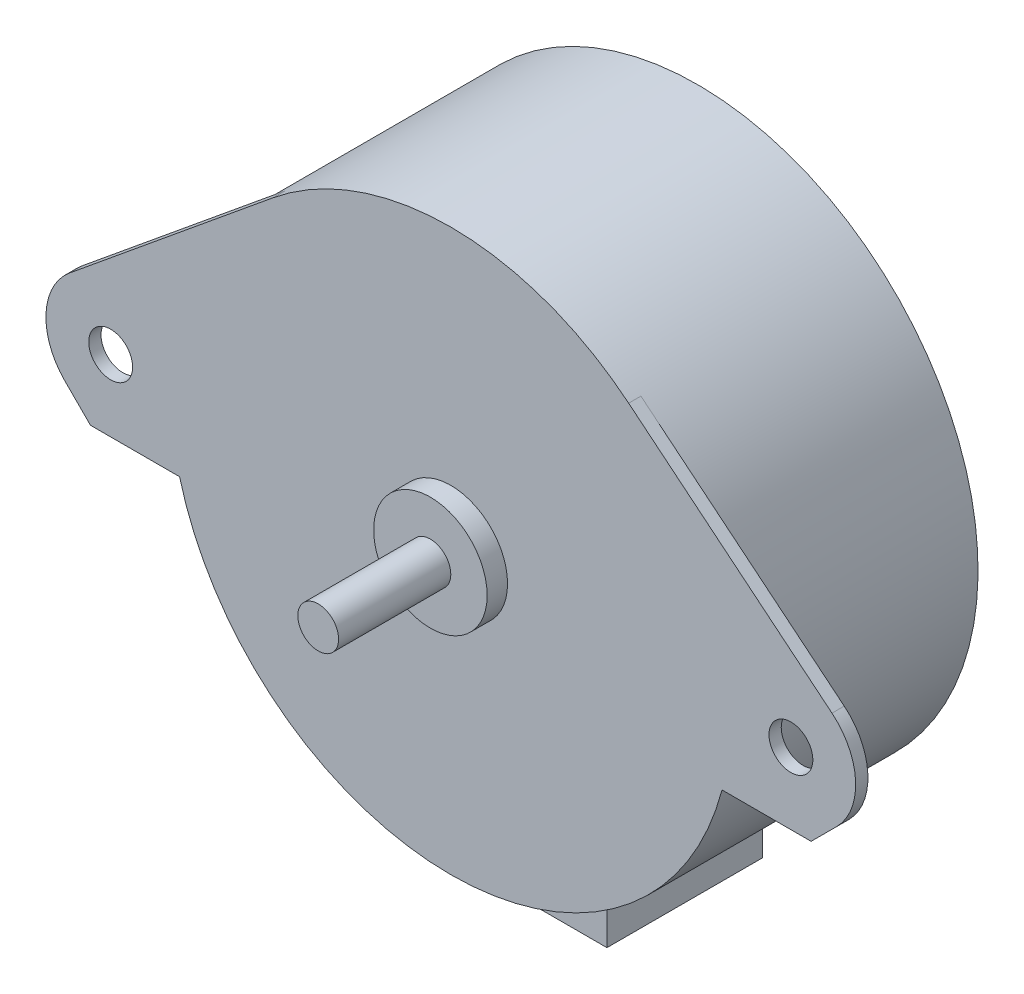
ISO-10303-21;
HEADER;
FILE_DESCRIPTION(('STEP AP214'),'2;1');
FILE_NAME('part.step','',(''),(''),'','','');
FILE_SCHEMA(('AUTOMOTIVE_DESIGN { 1 0 10303 214 1 1 1 1 }'));
ENDSEC;
DATA;
#1=APPLICATION_CONTEXT('core data for automotive mechanical design processes');
#2=APPLICATION_PROTOCOL_DEFINITION('international standard','automotive_design',2000,#1);
#3=PRODUCT_CONTEXT('',#1,'mechanical');
#4=PRODUCT('Part','Part','',(#3));
#5=PRODUCT_RELATED_PRODUCT_CATEGORY('part','',(#4));
#6=PRODUCT_DEFINITION_FORMATION('','',#4);
#7=PRODUCT_DEFINITION_CONTEXT('part definition',#1,'design');
#8=PRODUCT_DEFINITION('design','',#6,#7);
#9=PRODUCT_DEFINITION_SHAPE('','',#8);
#10=(LENGTH_UNIT() NAMED_UNIT(*) SI_UNIT(.MILLI.,.METRE.));
#11=(NAMED_UNIT(*) PLANE_ANGLE_UNIT() SI_UNIT($,.RADIAN.));
#12=(NAMED_UNIT(*) SI_UNIT($,.STERADIAN.) SOLID_ANGLE_UNIT());
#13=UNCERTAINTY_MEASURE_WITH_UNIT(LENGTH_MEASURE(1.E-05),#10,'distance_accuracy_value','');
#14=(GEOMETRIC_REPRESENTATION_CONTEXT(3) GLOBAL_UNCERTAINTY_ASSIGNED_CONTEXT((#13)) GLOBAL_UNIT_ASSIGNED_CONTEXT((#10,
#11,#12)) REPRESENTATION_CONTEXT('',''));
#15=CARTESIAN_POINT('',(0.,0.,0.));
#16=DIRECTION('',(0.,0.,1.));
#17=DIRECTION('',(1.,0.,0.));
#18=AXIS2_PLACEMENT_3D('',#15,#16,#17);
#19=CARTESIAN_POINT('',(0.,0.,0.));
#20=DIRECTION('',(0.,0.,1.));
#21=DIRECTION('',(1.,0.,0.));
#22=AXIS2_PLACEMENT_3D('',#19,#20,#21);
#23=PLANE('',#22);
#24=CARTESIAN_POINT('',(0.,0.,0.));
#25=DIRECTION('',(0.,0.,1.));
#26=DIRECTION('',(1.,0.,0.));
#27=AXIS2_PLACEMENT_3D('',#24,#25,#26);
#28=CIRCLE('',#27,2.);
#29=CARTESIAN_POINT('',(2.,0.,0.));
#30=VERTEX_POINT('',#29);
#31=EDGE_CURVE('E263',#30,#30,#28,.T.);
#32=ORIENTED_EDGE('',*,*,#31,.F.);
#33=EDGE_LOOP('',(#32));
#34=FACE_BOUND('',#33,.T.);
#35=ADVANCED_FACE('F33',(#34),#23,.F.);
#36=CARTESIAN_POINT('',(0.,0.,38.2));
#37=DIRECTION('',(0.,0.,1.));
#38=DIRECTION('',(1.,0.,0.));
#39=AXIS2_PLACEMENT_3D('',#36,#37,#38);
#40=CYLINDRICAL_SURFACE('',#39,2.);
#41=CARTESIAN_POINT('',(0.,0.,1.));
#42=DIRECTION('',(0.,0.,1.));
#43=DIRECTION('',(1.,0.,0.));
#44=AXIS2_PLACEMENT_3D('',#41,#42,#43);
#45=CIRCLE('',#44,2.);
#46=CARTESIAN_POINT('',(2.,0.,1.));
#47=VERTEX_POINT('',#46);
#48=EDGE_CURVE('E260',#47,#47,#45,.T.);
#49=ORIENTED_EDGE('',*,*,#48,.F.);
#50=EDGE_LOOP('',(#49));
#51=FACE_BOUND('',#50,.T.);
#52=ORIENTED_EDGE('',*,*,#31,.T.);
#53=EDGE_LOOP('',(#52));
#54=FACE_BOUND('',#53,.T.);
#55=ADVANCED_FACE('F287',(#51,#54),#40,.T.);
#56=CARTESIAN_POINT('',(0.,2.,1.));
#57=DIRECTION('',(0.,0.,1.));
#58=DIRECTION('',(1.,0.,0.));
#59=AXIS2_PLACEMENT_3D('',#56,#57,#58);
#60=PLANE('',#59);
#61=DIRECTION('',(0.,1.,0.));
#62=VECTOR('',#61,1.);
#63=CARTESIAN_POINT('',(-6.35,-35.,1.));
#64=LINE('',#63,#62);
#65=CARTESIAN_POINT('',(-6.35,-35.,1.));
#66=VERTEX_POINT('',#65);
#67=CARTESIAN_POINT('',(-6.35,-26.7568215601181,1.));
#68=VERTEX_POINT('',#67);
#69=EDGE_CURVE('E154',#66,#68,#64,.T.);
#70=ORIENTED_EDGE('',*,*,#69,.T.);
#71=CARTESIAN_POINT('',(0.,0.,1.));
#72=DIRECTION('',(0.,0.,1.));
#73=DIRECTION('',(1.,0.,0.));
#74=AXIS2_PLACEMENT_3D('',#71,#72,#73);
#75=CIRCLE('',#74,27.5);
#76=CARTESIAN_POINT('',(6.35,-26.7568215601181,1.));
#77=VERTEX_POINT('',#76);
#78=EDGE_CURVE('E257',#77,#68,#75,.T.);
#79=ORIENTED_EDGE('',*,*,#78,.F.);
#80=DIRECTION('',(0.,1.,0.));
#81=VECTOR('',#80,1.);
#82=CARTESIAN_POINT('',(6.35,-35.,1.));
#83=LINE('',#82,#81);
#84=CARTESIAN_POINT('',(6.35,-35.,1.));
#85=VERTEX_POINT('',#84);
#86=EDGE_CURVE('E161',#85,#77,#83,.T.);
#87=ORIENTED_EDGE('',*,*,#86,.F.);
#88=DIRECTION('',(-1.,0.,0.));
#89=VECTOR('',#88,1.);
#90=CARTESIAN_POINT('',(-6.35,-35.,1.));
#91=LINE('',#90,#89);
#92=EDGE_CURVE('E140',#85,#66,#91,.T.);
#93=ORIENTED_EDGE('',*,*,#92,.T.);
#94=EDGE_LOOP('',(#70,#79,#87,#93));
#95=FACE_BOUND('',#94,.T.);
#96=ORIENTED_EDGE('',*,*,#48,.T.);
#97=EDGE_LOOP('',(#96));
#98=FACE_BOUND('',#97,.T.);
#99=ADVANCED_FACE('F273',(#95,#98),#60,.F.);
#100=CARTESIAN_POINT('',(0.,0.,38.2));
#101=DIRECTION('',(0.,0.,1.));
#102=DIRECTION('',(1.,0.,0.));
#103=AXIS2_PLACEMENT_3D('',#100,#101,#102);
#104=CYLINDRICAL_SURFACE('',#103,27.5);
#105=ORIENTED_EDGE('',*,*,#78,.T.);
#106=DIRECTION('',(0.,0.,1.));
#107=VECTOR('',#106,1.);
#108=CARTESIAN_POINT('',(-6.35000000000001,-26.7568215601181,38.2));
#109=LINE('',#108,#107);
#110=CARTESIAN_POINT('',(-6.35,-26.7568215601181,16.24));
#111=VERTEX_POINT('',#110);
#112=EDGE_CURVE('E11',#68,#111,#109,.T.);
#113=ORIENTED_EDGE('',*,*,#112,.T.);
#114=CARTESIAN_POINT('',(0.,0.,16.24));
#115=DIRECTION('',(0.,0.,1.));
#116=DIRECTION('',(1.,0.,0.));
#117=AXIS2_PLACEMENT_3D('',#114,#115,#116);
#118=CIRCLE('',#117,27.5);
#119=CARTESIAN_POINT('',(6.35,-26.7568215601181,16.24));
#120=VERTEX_POINT('',#119);
#121=EDGE_CURVE('E137',#111,#120,#118,.T.);
#122=ORIENTED_EDGE('',*,*,#121,.T.);
#123=DIRECTION('',(0.,0.,1.));
#124=VECTOR('',#123,1.);
#125=CARTESIAN_POINT('',(6.35000000000001,-26.7568215601181,38.2));
#126=LINE('',#125,#124);
#127=EDGE_CURVE('E40',#120,#77,#126,.F.);
#128=ORIENTED_EDGE('',*,*,#127,.T.);
#129=EDGE_LOOP('',(#105,#113,#122,#128));
#130=FACE_BOUND('',#129,.T.);
#131=CARTESIAN_POINT('',(0.,0.,24.));
#132=DIRECTION('',(0.,0.,1.));
#133=DIRECTION('',(1.,0.,0.));
#134=AXIS2_PLACEMENT_3D('',#131,#132,#133);
#135=CIRCLE('',#134,27.5);
#136=CARTESIAN_POINT('',(-17.4400299850075,21.2625340475222,24.));
#137=VERTEX_POINT('',#136);
#138=CARTESIAN_POINT('',(-26.5941722939444,-7.,24.));
#139=VERTEX_POINT('',#138);
#140=EDGE_CURVE('E55',#137,#139,#135,.T.);
#141=ORIENTED_EDGE('',*,*,#140,.F.);
#142=DIRECTION('',(0.,0.,-1.));
#143=VECTOR('',#142,1.);
#144=CARTESIAN_POINT('',(-17.4400299850075,21.2625340475222,25.2));
#145=LINE('',#144,#143);
#146=CARTESIAN_POINT('',(-17.4400299850075,21.2625340475222,25.2));
#147=VERTEX_POINT('',#146);
#148=EDGE_CURVE('E243',#147,#137,#145,.T.);
#149=ORIENTED_EDGE('',*,*,#148,.F.);
#150=CARTESIAN_POINT('',(0.,0.,25.2));
#151=DIRECTION('',(0.,0.,1.));
#152=DIRECTION('',(1.,0.,0.));
#153=AXIS2_PLACEMENT_3D('',#150,#151,#152);
#154=CIRCLE('',#153,27.5);
#155=CARTESIAN_POINT('',(17.4400299850075,21.2625340475222,25.2));
#156=VERTEX_POINT('',#155);
#157=EDGE_CURVE('E179',#156,#147,#154,.T.);
#158=ORIENTED_EDGE('',*,*,#157,.F.);
#159=DIRECTION('',(0.,0.,-1.));
#160=VECTOR('',#159,1.);
#161=CARTESIAN_POINT('',(17.4400299850075,21.2625340475222,25.2));
#162=LINE('',#161,#160);
#163=CARTESIAN_POINT('',(17.4400299850075,21.2625340475222,24.));
#164=VERTEX_POINT('',#163);
#165=EDGE_CURVE('E201',#156,#164,#162,.T.);
#166=ORIENTED_EDGE('',*,*,#165,.T.);
#167=CARTESIAN_POINT('',(26.5941722939444,-7.,24.));
#168=VERTEX_POINT('',#167);
#169=EDGE_CURVE('E246',#168,#164,#135,.T.);
#170=ORIENTED_EDGE('',*,*,#169,.F.);
#171=DIRECTION('',(0.,0.,-1.));
#172=VECTOR('',#171,1.);
#173=CARTESIAN_POINT('',(26.5941722939444,-7.,25.2));
#174=LINE('',#173,#172);
#175=CARTESIAN_POINT('',(26.5941722939444,-7.,25.2));
#176=VERTEX_POINT('',#175);
#177=EDGE_CURVE('E228',#176,#168,#174,.T.);
#178=ORIENTED_EDGE('',*,*,#177,.F.);
#179=CARTESIAN_POINT('',(0.,0.,25.2));
#180=DIRECTION('',(0.,0.,1.));
#181=DIRECTION('',(1.,0.,0.));
#182=AXIS2_PLACEMENT_3D('',#179,#180,#181);
#183=CIRCLE('',#182,27.5);
#184=CARTESIAN_POINT('',(-26.5941722939444,-7.,25.2));
#185=VERTEX_POINT('',#184);
#186=EDGE_CURVE('E191',#185,#176,#183,.T.);
#187=ORIENTED_EDGE('',*,*,#186,.F.);
#188=DIRECTION('',(0.,0.,-1.));
#189=VECTOR('',#188,1.);
#190=CARTESIAN_POINT('',(-26.5941722939444,-7.,25.2));
#191=LINE('',#190,#189);
#192=EDGE_CURVE('E231',#185,#139,#191,.T.);
#193=ORIENTED_EDGE('',*,*,#192,.T.);
#194=EDGE_LOOP('',(#141,#149,#158,#166,#170,#178,#187,#193));
#195=FACE_BOUND('',#194,.T.);
#196=ADVANCED_FACE('F269',(#130,#195),#104,.T.);
#197=CARTESIAN_POINT('',(0.,0.,24.));
#198=DIRECTION('',(0.,0.,1.));
#199=DIRECTION('',(1.,0.,0.));
#200=AXIS2_PLACEMENT_3D('',#197,#198,#199);
#201=PLANE('',#200);
#202=CARTESIAN_POINT('',(-33.35,0.,24.));
#203=DIRECTION('',(0.,0.,1.));
#204=DIRECTION('',(1.,0.,0.));
#205=AXIS2_PLACEMENT_3D('',#202,#203,#204);
#206=CIRCLE('',#205,2.15);
#207=CARTESIAN_POINT('',(-31.2,0.,24.));
#208=VERTEX_POINT('',#207);
#209=EDGE_CURVE('E167',#208,#208,#206,.T.);
#210=ORIENTED_EDGE('',*,*,#209,.T.);
#211=EDGE_LOOP('',(#210));
#212=FACE_BOUND('',#211,.T.);
#213=DIRECTION('',(-0.773183056273534,-0.634182908545727,0.));
#214=VECTOR('',#213,1.);
#215=CARTESIAN_POINT('',(-17.4400299850075,21.2625340475222,24.));
#216=LINE('',#215,#214);
#217=CARTESIAN_POINT('',(-37.3770614692654,4.90971240733694,24.));
#218=VERTEX_POINT('',#217);
#219=EDGE_CURVE('E178',#137,#218,#216,.T.);
#220=ORIENTED_EDGE('',*,*,#219,.F.);
#221=ORIENTED_EDGE('',*,*,#140,.T.);
#222=DIRECTION('',(1.,0.,0.));
#223=VECTOR('',#222,1.);
#224=CARTESIAN_POINT('',(-35.3302561210692,-7.,24.));
#225=LINE('',#224,#223);
#226=CARTESIAN_POINT('',(-35.3302561210692,-7.,24.));
#227=VERTEX_POINT('',#226);
#228=EDGE_CURVE('E207',#227,#139,#225,.T.);
#229=ORIENTED_EDGE('',*,*,#228,.F.);
#230=DIRECTION('',(0.707106781186547,-0.707106781186548,0.));
#231=VECTOR('',#230,1.);
#232=CARTESIAN_POINT('',(-37.8401280605346,-4.49012806053457,24.));
#233=LINE('',#232,#231);
#234=CARTESIAN_POINT('',(-37.8401280605346,-4.49012806053457,24.));
#235=VERTEX_POINT('',#234);
#236=EDGE_CURVE('E205',#235,#227,#233,.T.);
#237=ORIENTED_EDGE('',*,*,#236,.F.);
#238=CARTESIAN_POINT('',(-33.35,0.,24.));
#239=DIRECTION('',(0.,0.,1.));
#240=DIRECTION('',(1.,0.,0.));
#241=AXIS2_PLACEMENT_3D('',#238,#239,#240);
#242=CIRCLE('',#241,6.35);
#243=EDGE_CURVE('E203',#218,#235,#242,.T.);
#244=ORIENTED_EDGE('',*,*,#243,.F.);
#245=EDGE_LOOP('',(#220,#221,#229,#237,#244));
#246=FACE_BOUND('',#245,.T.);
#247=ADVANCED_FACE('F303',(#212,#246),#201,.F.);
#248=CARTESIAN_POINT('',(33.35,0.,24.));
#249=DIRECTION('',(0.,0.,1.));
#250=DIRECTION('',(-1.,0.,0.));
#251=AXIS2_PLACEMENT_3D('',#248,#249,#250);
#252=CIRCLE('',#251,2.15);
#253=CARTESIAN_POINT('',(31.2,0.,24.));
#254=VERTEX_POINT('',#253);
#255=EDGE_CURVE('E160',#254,#254,#252,.T.);
#256=ORIENTED_EDGE('',*,*,#255,.T.);
#257=EDGE_LOOP('',(#256));
#258=FACE_BOUND('',#257,.T.);
#259=DIRECTION('',(1.,0.,0.));
#260=VECTOR('',#259,1.);
#261=CARTESIAN_POINT('',(35.3302561210692,-7.,24.));
#262=LINE('',#261,#260);
#263=CARTESIAN_POINT('',(35.3302561210692,-7.,24.));
#264=VERTEX_POINT('',#263);
#265=EDGE_CURVE('E209',#168,#264,#262,.T.);
#266=ORIENTED_EDGE('',*,*,#265,.F.);
#267=ORIENTED_EDGE('',*,*,#169,.T.);
#268=DIRECTION('',(-0.773183056273534,0.634182908545727,0.));
#269=VECTOR('',#268,1.);
#270=CARTESIAN_POINT('',(17.4400299850075,21.2625340475222,24.));
#271=LINE('',#270,#269);
#272=CARTESIAN_POINT('',(37.3770614692654,4.90971240733695,24.));
#273=VERTEX_POINT('',#272);
#274=EDGE_CURVE('E183',#273,#164,#271,.T.);
#275=ORIENTED_EDGE('',*,*,#274,.F.);
#276=CARTESIAN_POINT('',(33.35,0.,24.));
#277=DIRECTION('',(0.,0.,1.));
#278=DIRECTION('',(-1.,0.,0.));
#279=AXIS2_PLACEMENT_3D('',#276,#277,#278);
#280=CIRCLE('',#279,6.35);
#281=CARTESIAN_POINT('',(37.8401280605346,-4.49012806053457,24.));
#282=VERTEX_POINT('',#281);
#283=EDGE_CURVE('E213',#282,#273,#280,.T.);
#284=ORIENTED_EDGE('',*,*,#283,.F.);
#285=DIRECTION('',(0.707106781186547,0.707106781186548,0.));
#286=VECTOR('',#285,1.);
#287=CARTESIAN_POINT('',(37.8401280605346,-4.49012806053457,24.));
#288=LINE('',#287,#286);
#289=EDGE_CURVE('E211',#264,#282,#288,.T.);
#290=ORIENTED_EDGE('',*,*,#289,.F.);
#291=EDGE_LOOP('',(#266,#267,#275,#284,#290));
#292=FACE_BOUND('',#291,.T.);
#293=ADVANCED_FACE('F356',(#258,#292),#201,.F.);
#294=CARTESIAN_POINT('',(0.,0.,25.2));
#295=DIRECTION('',(0.,0.,1.));
#296=DIRECTION('',(1.,0.,0.));
#297=AXIS2_PLACEMENT_3D('',#294,#295,#296);
#298=PLANE('',#297);
#299=CARTESIAN_POINT('',(-33.35,0.,25.2));
#300=DIRECTION('',(0.,0.,1.));
#301=DIRECTION('',(1.,0.,0.));
#302=AXIS2_PLACEMENT_3D('',#299,#300,#301);
#303=CIRCLE('',#302,2.15);
#304=CARTESIAN_POINT('',(-31.2,0.,25.2));
#305=VERTEX_POINT('',#304);
#306=EDGE_CURVE('E170',#305,#305,#303,.T.);
#307=ORIENTED_EDGE('',*,*,#306,.F.);
#308=EDGE_LOOP('',(#307));
#309=FACE_BOUND('',#308,.T.);
#310=ORIENTED_EDGE('',*,*,#157,.T.);
#311=DIRECTION('',(-0.773183056273534,-0.634182908545727,0.));
#312=VECTOR('',#311,1.);
#313=CARTESIAN_POINT('',(-17.4400299850075,21.2625340475222,25.2));
#314=LINE('',#313,#312);
#315=CARTESIAN_POINT('',(-37.3770614692654,4.90971240733694,25.2));
#316=VERTEX_POINT('',#315);
#317=EDGE_CURVE('E182',#147,#316,#314,.T.);
#318=ORIENTED_EDGE('',*,*,#317,.T.);
#319=CARTESIAN_POINT('',(-33.35,0.,25.2));
#320=DIRECTION('',(0.,0.,1.));
#321=DIRECTION('',(1.,0.,0.));
#322=AXIS2_PLACEMENT_3D('',#319,#320,#321);
#323=CIRCLE('',#322,6.35);
#324=CARTESIAN_POINT('',(-37.8401280605346,-4.49012806053457,25.2));
#325=VERTEX_POINT('',#324);
#326=EDGE_CURVE('E185',#316,#325,#323,.T.);
#327=ORIENTED_EDGE('',*,*,#326,.T.);
#328=DIRECTION('',(0.707106781186547,-0.707106781186548,0.));
#329=VECTOR('',#328,1.);
#330=CARTESIAN_POINT('',(-37.8401280605346,-4.49012806053457,25.2));
#331=LINE('',#330,#329);
#332=CARTESIAN_POINT('',(-35.3302561210692,-7.,25.2));
#333=VERTEX_POINT('',#332);
#334=EDGE_CURVE('E187',#325,#333,#331,.T.);
#335=ORIENTED_EDGE('',*,*,#334,.T.);
#336=DIRECTION('',(1.,0.,0.));
#337=VECTOR('',#336,1.);
#338=CARTESIAN_POINT('',(-35.3302561210692,-7.,25.2));
#339=LINE('',#338,#337);
#340=EDGE_CURVE('E189',#333,#185,#339,.T.);
#341=ORIENTED_EDGE('',*,*,#340,.T.);
#342=ORIENTED_EDGE('',*,*,#186,.T.);
#343=DIRECTION('',(1.,0.,0.));
#344=VECTOR('',#343,1.);
#345=CARTESIAN_POINT('',(35.3302561210692,-7.,25.2));
#346=LINE('',#345,#344);
#347=CARTESIAN_POINT('',(35.3302561210692,-7.,25.2));
#348=VERTEX_POINT('',#347);
#349=EDGE_CURVE('E193',#176,#348,#346,.T.);
#350=ORIENTED_EDGE('',*,*,#349,.T.);
#351=DIRECTION('',(0.707106781186547,0.707106781186548,0.));
#352=VECTOR('',#351,1.);
#353=CARTESIAN_POINT('',(37.8401280605346,-4.49012806053457,25.2));
#354=LINE('',#353,#352);
#355=CARTESIAN_POINT('',(37.8401280605346,-4.49012806053457,25.2));
#356=VERTEX_POINT('',#355);
#357=EDGE_CURVE('E195',#348,#356,#354,.T.);
#358=ORIENTED_EDGE('',*,*,#357,.T.);
#359=CARTESIAN_POINT('',(33.35,0.,25.2));
#360=DIRECTION('',(0.,0.,1.));
#361=DIRECTION('',(-1.,0.,0.));
#362=AXIS2_PLACEMENT_3D('',#359,#360,#361);
#363=CIRCLE('',#362,6.35);
#364=CARTESIAN_POINT('',(37.3770614692654,4.90971240733695,25.2));
#365=VERTEX_POINT('',#364);
#366=EDGE_CURVE('E197',#356,#365,#363,.T.);
#367=ORIENTED_EDGE('',*,*,#366,.T.);
#368=DIRECTION('',(-0.773183056273534,0.634182908545727,0.));
#369=VECTOR('',#368,1.);
#370=CARTESIAN_POINT('',(17.4400299850075,21.2625340475222,25.2));
#371=LINE('',#370,#369);
#372=EDGE_CURVE('E199',#365,#156,#371,.T.);
#373=ORIENTED_EDGE('',*,*,#372,.T.);
#374=EDGE_LOOP('',(#310,#318,#327,#335,#341,#342,#350,#358,#367,#373));
#375=FACE_BOUND('',#374,.T.);
#376=CARTESIAN_POINT('',(0.,0.,25.2));
#377=DIRECTION('',(0.,0.,1.));
#378=DIRECTION('',(1.,0.,0.));
#379=AXIS2_PLACEMENT_3D('',#376,#377,#378);
#380=CIRCLE('',#379,5.565);
#381=CARTESIAN_POINT('',(5.565,0.,25.2));
#382=VERTEX_POINT('',#381);
#383=EDGE_CURVE('E173',#382,#382,#380,.T.);
#384=ORIENTED_EDGE('',*,*,#383,.F.);
#385=EDGE_LOOP('',(#384));
#386=FACE_BOUND('',#385,.T.);
#387=CARTESIAN_POINT('',(33.35,0.,25.2));
#388=DIRECTION('',(0.,0.,1.));
#389=DIRECTION('',(-1.,0.,0.));
#390=AXIS2_PLACEMENT_3D('',#387,#388,#389);
#391=CIRCLE('',#390,2.15);
#392=CARTESIAN_POINT('',(31.2,0.,25.2));
#393=VERTEX_POINT('',#392);
#394=EDGE_CURVE('E164',#393,#393,#391,.T.);
#395=ORIENTED_EDGE('',*,*,#394,.F.);
#396=EDGE_LOOP('',(#395));
#397=FACE_BOUND('',#396,.T.);
#398=ADVANCED_FACE('F324',(#309,#375,#386,#397),#298,.T.);
#399=CARTESIAN_POINT('',(-17.4400299850075,21.2625340475222,25.2));
#400=DIRECTION('',(0.634182908545727,-0.773183056273533,0.));
#401=DIRECTION('',(0.773183056273534,0.634182908545727,0.));
#402=AXIS2_PLACEMENT_3D('',#399,#400,#401);
#403=PLANE('',#402);
#404=ORIENTED_EDGE('',*,*,#219,.T.);
#405=DIRECTION('',(0.,0.,-1.));
#406=VECTOR('',#405,1.);
#407=CARTESIAN_POINT('',(-37.3770614692654,4.90971240733694,25.2));
#408=LINE('',#407,#406);
#409=EDGE_CURVE('E240',#316,#218,#408,.T.);
#410=ORIENTED_EDGE('',*,*,#409,.F.);
#411=ORIENTED_EDGE('',*,*,#317,.F.);
#412=ORIENTED_EDGE('',*,*,#148,.T.);
#413=EDGE_LOOP('',(#404,#410,#411,#412));
#414=FACE_BOUND('',#413,.T.);
#415=ADVANCED_FACE('F320',(#414),#403,.F.);
#416=CARTESIAN_POINT('',(-33.35,0.,25.2));
#417=DIRECTION('',(0.,0.,-1.));
#418=DIRECTION('',(-1.,0.,0.));
#419=AXIS2_PLACEMENT_3D('',#416,#417,#418);
#420=CYLINDRICAL_SURFACE('',#419,6.35);
#421=ORIENTED_EDGE('',*,*,#243,.T.);
#422=DIRECTION('',(0.,0.,-1.));
#423=VECTOR('',#422,1.);
#424=CARTESIAN_POINT('',(-37.8401280605346,-4.49012806053457,25.2));
#425=LINE('',#424,#423);
#426=EDGE_CURVE('E237',#325,#235,#425,.T.);
#427=ORIENTED_EDGE('',*,*,#426,.F.);
#428=ORIENTED_EDGE('',*,*,#326,.F.);
#429=ORIENTED_EDGE('',*,*,#409,.T.);
#430=EDGE_LOOP('',(#421,#427,#428,#429));
#431=FACE_BOUND('',#430,.T.);
#432=ADVANCED_FACE('F323',(#431),#420,.T.);
#433=CARTESIAN_POINT('',(-37.8401280605346,-4.49012806053457,25.2));
#434=DIRECTION('',(0.707106781186548,0.707106781186547,0.));
#435=DIRECTION('',(-0.707106781186547,0.707106781186548,0.));
#436=AXIS2_PLACEMENT_3D('',#433,#434,#435);
#437=PLANE('',#436);
#438=ORIENTED_EDGE('',*,*,#236,.T.);
#439=DIRECTION('',(0.,0.,-1.));
#440=VECTOR('',#439,1.);
#441=CARTESIAN_POINT('',(-35.3302561210692,-7.,25.2));
#442=LINE('',#441,#440);
#443=EDGE_CURVE('E234',#333,#227,#442,.T.);
#444=ORIENTED_EDGE('',*,*,#443,.F.);
#445=ORIENTED_EDGE('',*,*,#334,.F.);
#446=ORIENTED_EDGE('',*,*,#426,.T.);
#447=EDGE_LOOP('',(#438,#444,#445,#446));
#448=FACE_BOUND('',#447,.T.);
#449=ADVANCED_FACE('F328',(#448),#437,.F.);
#450=CARTESIAN_POINT('',(-35.3302561210692,-7.,25.2));
#451=DIRECTION('',(0.,1.,0.));
#452=DIRECTION('',(0.,0.,1.));
#453=AXIS2_PLACEMENT_3D('',#450,#451,#452);
#454=PLANE('',#453);
#455=ORIENTED_EDGE('',*,*,#228,.T.);
#456=ORIENTED_EDGE('',*,*,#192,.F.);
#457=ORIENTED_EDGE('',*,*,#340,.F.);
#458=ORIENTED_EDGE('',*,*,#443,.T.);
#459=EDGE_LOOP('',(#455,#456,#457,#458));
#460=FACE_BOUND('',#459,.T.);
#461=ADVANCED_FACE('F332',(#460),#454,.F.);
#462=CARTESIAN_POINT('',(35.3302561210692,-7.,25.2));
#463=DIRECTION('',(0.,1.,0.));
#464=DIRECTION('',(-1.,0.,0.));
#465=AXIS2_PLACEMENT_3D('',#462,#463,#464);
#466=PLANE('',#465);
#467=ORIENTED_EDGE('',*,*,#265,.T.);
#468=DIRECTION('',(0.,0.,-1.));
#469=VECTOR('',#468,1.);
#470=CARTESIAN_POINT('',(35.3302561210692,-7.,25.2));
#471=LINE('',#470,#469);
#472=EDGE_CURVE('E225',#348,#264,#471,.T.);
#473=ORIENTED_EDGE('',*,*,#472,.F.);
#474=ORIENTED_EDGE('',*,*,#349,.F.);
#475=ORIENTED_EDGE('',*,*,#177,.T.);
#476=EDGE_LOOP('',(#467,#473,#474,#475));
#477=FACE_BOUND('',#476,.T.);
#478=ADVANCED_FACE('F336',(#477),#466,.F.);
#479=CARTESIAN_POINT('',(37.8401280605346,-4.49012806053457,25.2));
#480=DIRECTION('',(-0.707106781186548,0.707106781186547,0.));
#481=DIRECTION('',(-0.707106781186547,-0.707106781186548,0.));
#482=AXIS2_PLACEMENT_3D('',#479,#480,#481);
#483=PLANE('',#482);
#484=ORIENTED_EDGE('',*,*,#289,.T.);
#485=DIRECTION('',(0.,0.,-1.));
#486=VECTOR('',#485,1.);
#487=CARTESIAN_POINT('',(37.8401280605346,-4.49012806053457,25.2));
#488=LINE('',#487,#486);
#489=EDGE_CURVE('E222',#356,#282,#488,.T.);
#490=ORIENTED_EDGE('',*,*,#489,.F.);
#491=ORIENTED_EDGE('',*,*,#357,.F.);
#492=ORIENTED_EDGE('',*,*,#472,.T.);
#493=EDGE_LOOP('',(#484,#490,#491,#492));
#494=FACE_BOUND('',#493,.T.);
#495=ADVANCED_FACE('F340',(#494),#483,.F.);
#496=CARTESIAN_POINT('',(33.35,0.,25.2));
#497=DIRECTION('',(0.,0.,-1.));
#498=DIRECTION('',(-1.,0.,0.));
#499=AXIS2_PLACEMENT_3D('',#496,#497,#498);
#500=CYLINDRICAL_SURFACE('',#499,6.35);
#501=ORIENTED_EDGE('',*,*,#283,.T.);
#502=DIRECTION('',(0.,0.,-1.));
#503=VECTOR('',#502,1.);
#504=CARTESIAN_POINT('',(37.3770614692654,4.90971240733695,25.2));
#505=LINE('',#504,#503);
#506=EDGE_CURVE('E219',#365,#273,#505,.T.);
#507=ORIENTED_EDGE('',*,*,#506,.F.);
#508=ORIENTED_EDGE('',*,*,#366,.F.);
#509=ORIENTED_EDGE('',*,*,#489,.T.);
#510=EDGE_LOOP('',(#501,#507,#508,#509));
#511=FACE_BOUND('',#510,.T.);
#512=ADVANCED_FACE('F344',(#511),#500,.T.);
#513=CARTESIAN_POINT('',(17.4400299850075,21.2625340475222,25.2));
#514=DIRECTION('',(-0.634182908545727,-0.773183056273534,0.));
#515=DIRECTION('',(0.773183056273534,-0.634182908545727,0.));
#516=AXIS2_PLACEMENT_3D('',#513,#514,#515);
#517=PLANE('',#516);
#518=ORIENTED_EDGE('',*,*,#274,.T.);
#519=ORIENTED_EDGE('',*,*,#165,.F.);
#520=ORIENTED_EDGE('',*,*,#372,.F.);
#521=ORIENTED_EDGE('',*,*,#506,.T.);
#522=EDGE_LOOP('',(#518,#519,#520,#521));
#523=FACE_BOUND('',#522,.T.);
#524=ADVANCED_FACE('F348',(#523),#517,.F.);
#525=CARTESIAN_POINT('',(-33.35,0.,25.2));
#526=DIRECTION('',(0.,0.,-1.));
#527=DIRECTION('',(-1.,0.,0.));
#528=AXIS2_PLACEMENT_3D('',#525,#526,#527);
#529=CYLINDRICAL_SURFACE('',#528,2.15);
#530=ORIENTED_EDGE('',*,*,#306,.T.);
#531=EDGE_LOOP('',(#530));
#532=FACE_BOUND('',#531,.T.);
#533=ORIENTED_EDGE('',*,*,#209,.F.);
#534=EDGE_LOOP('',(#533));
#535=FACE_BOUND('',#534,.T.);
#536=ADVANCED_FACE('F352',(#532,#535),#529,.F.);
#537=CARTESIAN_POINT('',(33.35,0.,25.2));
#538=DIRECTION('',(0.,0.,-1.));
#539=DIRECTION('',(-1.,0.,0.));
#540=AXIS2_PLACEMENT_3D('',#537,#538,#539);
#541=CYLINDRICAL_SURFACE('',#540,2.15);
#542=ORIENTED_EDGE('',*,*,#394,.T.);
#543=EDGE_LOOP('',(#542));
#544=FACE_BOUND('',#543,.T.);
#545=ORIENTED_EDGE('',*,*,#255,.F.);
#546=EDGE_LOOP('',(#545));
#547=FACE_BOUND('',#546,.T.);
#548=ADVANCED_FACE('F318',(#544,#547),#541,.F.);
#549=CARTESIAN_POINT('',(0.,2.,38.2));
#550=DIRECTION('',(0.,0.,-1.));
#551=DIRECTION('',(-1.,0.,0.));
#552=AXIS2_PLACEMENT_3D('',#549,#550,#551);
#553=PLANE('',#552);
#554=CARTESIAN_POINT('',(0.,0.,38.2));
#555=DIRECTION('',(0.,0.,1.));
#556=DIRECTION('',(1.,0.,0.));
#557=AXIS2_PLACEMENT_3D('',#554,#555,#556);
#558=CIRCLE('',#557,2.);
#559=CARTESIAN_POINT('',(2.,0.,38.2));
#560=VERTEX_POINT('',#559);
#561=EDGE_CURVE('E248',#560,#560,#558,.T.);
#562=ORIENTED_EDGE('',*,*,#561,.T.);
#563=EDGE_LOOP('',(#562));
#564=FACE_BOUND('',#563,.T.);
#565=ADVANCED_FACE('F314',(#564),#553,.F.);
#566=CARTESIAN_POINT('',(0.,0.,38.2));
#567=DIRECTION('',(0.,0.,1.));
#568=DIRECTION('',(1.,0.,0.));
#569=AXIS2_PLACEMENT_3D('',#566,#567,#568);
#570=CYLINDRICAL_SURFACE('',#569,2.);
#571=ORIENTED_EDGE('',*,*,#561,.F.);
#572=EDGE_LOOP('',(#571));
#573=FACE_BOUND('',#572,.T.);
#574=CARTESIAN_POINT('',(0.,0.,27.2));
#575=DIRECTION('',(0.,0.,1.));
#576=DIRECTION('',(1.,0.,0.));
#577=AXIS2_PLACEMENT_3D('',#574,#575,#576);
#578=CIRCLE('',#577,2.);
#579=CARTESIAN_POINT('',(2.,0.,27.2));
#580=VERTEX_POINT('',#579);
#581=EDGE_CURVE('E251',#580,#580,#578,.T.);
#582=ORIENTED_EDGE('',*,*,#581,.T.);
#583=EDGE_LOOP('',(#582));
#584=FACE_BOUND('',#583,.T.);
#585=ADVANCED_FACE('F310',(#573,#584),#570,.T.);
#586=CARTESIAN_POINT('',(0.,5.565,27.2));
#587=DIRECTION('',(0.,0.,-1.));
#588=DIRECTION('',(-1.,0.,0.));
#589=AXIS2_PLACEMENT_3D('',#586,#587,#588);
#590=PLANE('',#589);
#591=ORIENTED_EDGE('',*,*,#581,.F.);
#592=EDGE_LOOP('',(#591));
#593=FACE_BOUND('',#592,.T.);
#594=CARTESIAN_POINT('',(0.,0.,27.2));
#595=DIRECTION('',(0.,0.,1.));
#596=DIRECTION('',(1.,0.,0.));
#597=AXIS2_PLACEMENT_3D('',#594,#595,#596);
#598=CIRCLE('',#597,5.565);
#599=CARTESIAN_POINT('',(5.565,0.,27.2));
#600=VERTEX_POINT('',#599);
#601=EDGE_CURVE('E254',#600,#600,#598,.T.);
#602=ORIENTED_EDGE('',*,*,#601,.T.);
#603=EDGE_LOOP('',(#602));
#604=FACE_BOUND('',#603,.T.);
#605=ADVANCED_FACE('F306',(#593,#604),#590,.F.);
#606=CARTESIAN_POINT('',(0.,0.,38.2));
#607=DIRECTION('',(0.,0.,1.));
#608=DIRECTION('',(1.,0.,0.));
#609=AXIS2_PLACEMENT_3D('',#606,#607,#608);
#610=CYLINDRICAL_SURFACE('',#609,5.565);
#611=ORIENTED_EDGE('',*,*,#383,.T.);
#612=EDGE_LOOP('',(#611));
#613=FACE_BOUND('',#612,.T.);
#614=ORIENTED_EDGE('',*,*,#601,.F.);
#615=EDGE_LOOP('',(#614));
#616=FACE_BOUND('',#615,.T.);
#617=ADVANCED_FACE('F283',(#613,#616),#610,.T.);
#618=CARTESIAN_POINT('',(-6.35,-35.,1.));
#619=DIRECTION('',(-1.,0.,0.));
#620=DIRECTION('',(0.,0.,1.));
#621=AXIS2_PLACEMENT_3D('',#618,#619,#620);
#622=PLANE('',#621);
#623=ORIENTED_EDGE('',*,*,#112,.F.);
#624=ORIENTED_EDGE('',*,*,#69,.F.);
#625=DIRECTION('',(0.,0.,1.));
#626=VECTOR('',#625,1.);
#627=CARTESIAN_POINT('',(-6.35,-35.,1.));
#628=LINE('',#627,#626);
#629=CARTESIAN_POINT('',(-6.35,-35.,16.24));
#630=VERTEX_POINT('',#629);
#631=EDGE_CURVE('E147',#66,#630,#628,.T.);
#632=ORIENTED_EDGE('',*,*,#631,.T.);
#633=DIRECTION('',(0.,1.,0.));
#634=VECTOR('',#633,1.);
#635=CARTESIAN_POINT('',(-6.35,-35.,16.24));
#636=LINE('',#635,#634);
#637=EDGE_CURVE('E132',#630,#111,#636,.T.);
#638=ORIENTED_EDGE('',*,*,#637,.T.);
#639=EDGE_LOOP('',(#623,#624,#632,#638));
#640=FACE_BOUND('',#639,.T.);
#641=ADVANCED_FACE('F152',(#640),#622,.T.);
#642=CARTESIAN_POINT('',(6.35,-35.,1.));
#643=DIRECTION('',(1.,0.,0.));
#644=DIRECTION('',(0.,0.,-1.));
#645=AXIS2_PLACEMENT_3D('',#642,#643,#644);
#646=PLANE('',#645);
#647=ORIENTED_EDGE('',*,*,#127,.F.);
#648=DIRECTION('',(0.,1.,0.));
#649=VECTOR('',#648,1.);
#650=CARTESIAN_POINT('',(6.35,-35.,16.24));
#651=LINE('',#650,#649);
#652=CARTESIAN_POINT('',(6.35,-35.,16.24));
#653=VERTEX_POINT('',#652);
#654=EDGE_CURVE('E47',#653,#120,#651,.T.);
#655=ORIENTED_EDGE('',*,*,#654,.F.);
#656=DIRECTION('',(0.,0.,-1.));
#657=VECTOR('',#656,1.);
#658=CARTESIAN_POINT('',(6.35,-35.,1.));
#659=LINE('',#658,#657);
#660=EDGE_CURVE('E150',#653,#85,#659,.T.);
#661=ORIENTED_EDGE('',*,*,#660,.T.);
#662=ORIENTED_EDGE('',*,*,#86,.T.);
#663=EDGE_LOOP('',(#647,#655,#661,#662));
#664=FACE_BOUND('',#663,.T.);
#665=ADVANCED_FACE('F275',(#664),#646,.T.);
#666=CARTESIAN_POINT('',(-6.35,-35.,16.24));
#667=DIRECTION('',(0.,0.,1.));
#668=DIRECTION('',(1.,0.,0.));
#669=AXIS2_PLACEMENT_3D('',#666,#667,#668);
#670=PLANE('',#669);
#671=ORIENTED_EDGE('',*,*,#121,.F.);
#672=ORIENTED_EDGE('',*,*,#637,.F.);
#673=DIRECTION('',(1.,0.,0.));
#674=VECTOR('',#673,1.);
#675=CARTESIAN_POINT('',(-6.35,-35.,16.24));
#676=LINE('',#675,#674);
#677=EDGE_CURVE('E135',#630,#653,#676,.T.);
#678=ORIENTED_EDGE('',*,*,#677,.T.);
#679=ORIENTED_EDGE('',*,*,#654,.T.);
#680=EDGE_LOOP('',(#671,#672,#678,#679));
#681=FACE_BOUND('',#680,.T.);
#682=ADVANCED_FACE('F134',(#681),#670,.T.);
#683=CARTESIAN_POINT('',(0.,-35.,0.));
#684=DIRECTION('',(0.,1.,0.));
#685=DIRECTION('',(0.,0.,1.));
#686=AXIS2_PLACEMENT_3D('',#683,#684,#685);
#687=PLANE('',#686);
#688=ORIENTED_EDGE('',*,*,#631,.F.);
#689=ORIENTED_EDGE('',*,*,#92,.F.);
#690=ORIENTED_EDGE('',*,*,#660,.F.);
#691=ORIENTED_EDGE('',*,*,#677,.F.);
#692=EDGE_LOOP('',(#688,#689,#690,#691));
#693=FACE_BOUND('',#692,.T.);
#694=ADVANCED_FACE('F145',(#693),#687,.F.);
#695=CLOSED_SHELL('',(#35,#55,#99,#196,#247,#293,#398,#415,#432,#449,#461,#478,#495,#512,#524,
#536,#548,#565,#585,#605,#617,#641,#665,#682,#694));
#696=MANIFOLD_SOLID_BREP('B2',#695);
#697=ADVANCED_BREP_SHAPE_REPRESENTATION('',(#18,#696),#14);
#698=SHAPE_DEFINITION_REPRESENTATION(#9,#697);
ENDSEC;
END-ISO-10303-21;
